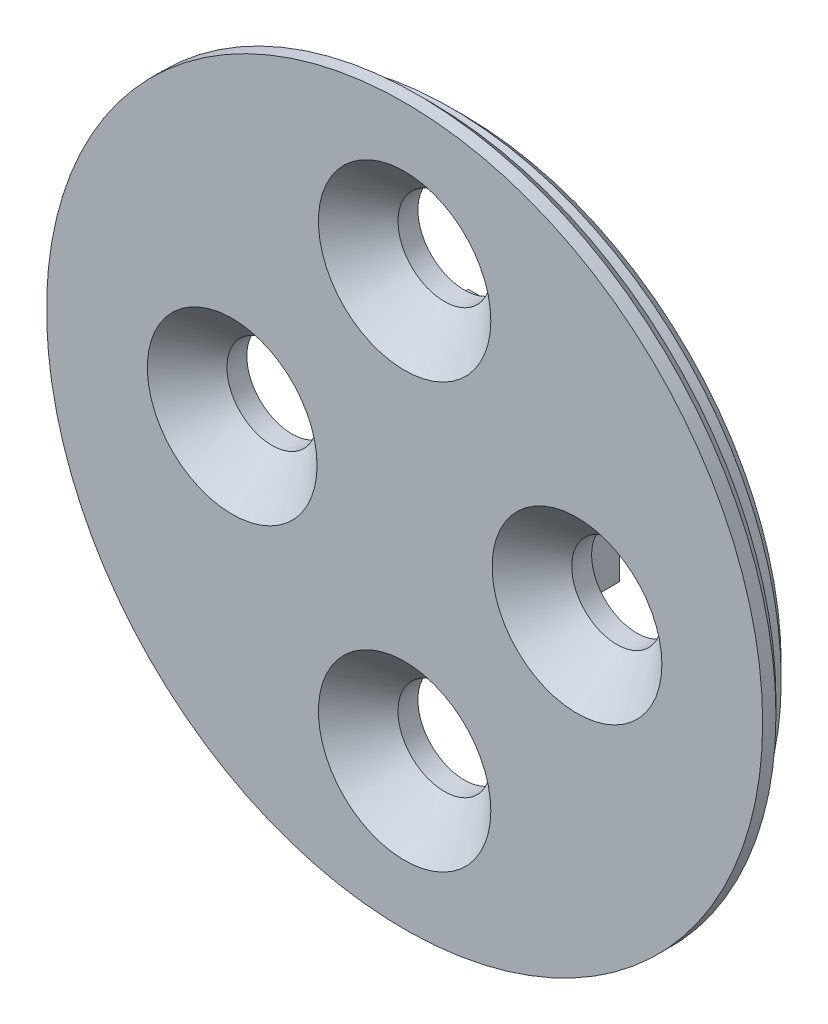
ISO-10303-21;
HEADER;
FILE_DESCRIPTION(('STEP AP214'),'2;1');
FILE_NAME('part.step','',(''),(''),'','','');
FILE_SCHEMA(('AUTOMOTIVE_DESIGN { 1 0 10303 214 1 1 1 1 }'));
ENDSEC;
DATA;
#1=APPLICATION_CONTEXT('core data for automotive mechanical design processes');
#2=APPLICATION_PROTOCOL_DEFINITION('international standard','automotive_design',2000,#1);
#3=PRODUCT_CONTEXT('',#1,'mechanical');
#4=PRODUCT('Part','Part','',(#3));
#5=PRODUCT_RELATED_PRODUCT_CATEGORY('part','',(#4));
#6=PRODUCT_DEFINITION_FORMATION('','',#4);
#7=PRODUCT_DEFINITION_CONTEXT('part definition',#1,'design');
#8=PRODUCT_DEFINITION('design','',#6,#7);
#9=PRODUCT_DEFINITION_SHAPE('','',#8);
#10=(LENGTH_UNIT() NAMED_UNIT(*) SI_UNIT(.MILLI.,.METRE.));
#11=(NAMED_UNIT(*) PLANE_ANGLE_UNIT() SI_UNIT($,.RADIAN.));
#12=(NAMED_UNIT(*) SI_UNIT($,.STERADIAN.) SOLID_ANGLE_UNIT());
#13=UNCERTAINTY_MEASURE_WITH_UNIT(LENGTH_MEASURE(1.E-05),#10,'distance_accuracy_value','');
#14=(GEOMETRIC_REPRESENTATION_CONTEXT(3) GLOBAL_UNCERTAINTY_ASSIGNED_CONTEXT((#13)) GLOBAL_UNIT_ASSIGNED_CONTEXT((#10,
#11,#12)) REPRESENTATION_CONTEXT('',''));
#15=CARTESIAN_POINT('',(0.,0.,0.));
#16=DIRECTION('',(0.,0.,1.));
#17=DIRECTION('',(1.,0.,0.));
#18=AXIS2_PLACEMENT_3D('',#15,#16,#17);
#19=CARTESIAN_POINT('',(0.,0.,-1.25));
#20=DIRECTION('',(0.,0.,1.));
#21=DIRECTION('',(1.,0.,0.));
#22=AXIS2_PLACEMENT_3D('',#19,#20,#21);
#23=PLANE('',#22);
#24=CARTESIAN_POINT('',(0.,8.,-1.25));
#25=DIRECTION('',(0.,0.,1.));
#26=DIRECTION('',(1.,0.,0.));
#27=AXIS2_PLACEMENT_3D('',#24,#25,#26);
#28=CIRCLE('',#27,1.75);
#29=CARTESIAN_POINT('',(1.75,8.,-1.25));
#30=VERTEX_POINT('',#29);
#31=EDGE_CURVE('E179',#30,#30,#28,.T.);
#32=ORIENTED_EDGE('',*,*,#31,.T.);
#33=EDGE_LOOP('',(#32));
#34=FACE_BOUND('',#33,.T.);
#35=CARTESIAN_POINT('',(0.,-8.,-1.25));
#36=DIRECTION('',(0.,0.,1.));
#37=DIRECTION('',(1.,0.,0.));
#38=AXIS2_PLACEMENT_3D('',#35,#36,#37);
#39=CIRCLE('',#38,1.75);
#40=CARTESIAN_POINT('',(1.75,-8.,-1.25));
#41=VERTEX_POINT('',#40);
#42=EDGE_CURVE('E365',#41,#41,#39,.T.);
#43=ORIENTED_EDGE('',*,*,#42,.T.);
#44=EDGE_LOOP('',(#43));
#45=FACE_BOUND('',#44,.T.);
#46=CARTESIAN_POINT('',(0.,0.,-1.25));
#47=DIRECTION('',(0.,0.,1.));
#48=DIRECTION('',(1.,0.,0.));
#49=AXIS2_PLACEMENT_3D('',#46,#47,#48);
#50=CIRCLE('',#49,11.95);
#51=CARTESIAN_POINT('',(11.95,0.,-1.25));
#52=VERTEX_POINT('',#51);
#53=EDGE_CURVE('E170',#52,#52,#50,.F.);
#54=ORIENTED_EDGE('',*,*,#53,.T.);
#55=EDGE_LOOP('',(#54));
#56=FACE_BOUND('',#55,.T.);
#57=CARTESIAN_POINT('',(-6.5,0.,-1.25));
#58=DIRECTION('',(0.,0.,1.));
#59=DIRECTION('',(1.,0.,0.));
#60=AXIS2_PLACEMENT_3D('',#57,#58,#59);
#61=CIRCLE('',#60,1.7);
#62=CARTESIAN_POINT('',(-4.8,0.,-1.25));
#63=VERTEX_POINT('',#62);
#64=EDGE_CURVE('E134',#63,#63,#61,.T.);
#65=ORIENTED_EDGE('',*,*,#64,.T.);
#66=EDGE_LOOP('',(#65));
#67=FACE_BOUND('',#66,.T.);
#68=CARTESIAN_POINT('',(6.5,0.,-1.25));
#69=DIRECTION('',(0.,0.,1.));
#70=DIRECTION('',(-1.,0.,0.));
#71=AXIS2_PLACEMENT_3D('',#68,#69,#70);
#72=CIRCLE('',#71,1.7);
#73=CARTESIAN_POINT('',(4.8,0.,-1.25));
#74=VERTEX_POINT('',#73);
#75=EDGE_CURVE('E130',#74,#74,#72,.T.);
#76=ORIENTED_EDGE('',*,*,#75,.T.);
#77=EDGE_LOOP('',(#76));
#78=FACE_BOUND('',#77,.T.);
#79=DIRECTION('',(0.,1.,0.));
#80=VECTOR('',#79,1.);
#81=CARTESIAN_POINT('',(-2.85,3.35,-1.25));
#82=LINE('',#81,#80);
#83=CARTESIAN_POINT('',(-2.85,-3.35,-1.25));
#84=VERTEX_POINT('',#83);
#85=CARTESIAN_POINT('',(-2.85,3.35,-1.25));
#86=VERTEX_POINT('',#85);
#87=EDGE_CURVE('E98',#84,#86,#82,.T.);
#88=ORIENTED_EDGE('',*,*,#87,.F.);
#89=DIRECTION('',(-1.,0.,0.));
#90=VECTOR('',#89,1.);
#91=CARTESIAN_POINT('',(2.85,-3.35,-1.25));
#92=LINE('',#91,#90);
#93=CARTESIAN_POINT('',(2.85,-3.35,-1.25));
#94=VERTEX_POINT('',#93);
#95=EDGE_CURVE('E102',#94,#84,#92,.T.);
#96=ORIENTED_EDGE('',*,*,#95,.F.);
#97=DIRECTION('',(0.,-1.,0.));
#98=VECTOR('',#97,1.);
#99=CARTESIAN_POINT('',(2.85,3.35,-1.25));
#100=LINE('',#99,#98);
#101=CARTESIAN_POINT('',(2.85,3.35,-1.25));
#102=VERTEX_POINT('',#101);
#103=EDGE_CURVE('E116',#102,#94,#100,.T.);
#104=ORIENTED_EDGE('',*,*,#103,.F.);
#105=DIRECTION('',(1.,0.,0.));
#106=VECTOR('',#105,1.);
#107=CARTESIAN_POINT('',(2.85,3.35,-1.25));
#108=LINE('',#107,#106);
#109=EDGE_CURVE('E110',#86,#102,#108,.T.);
#110=ORIENTED_EDGE('',*,*,#109,.F.);
#111=EDGE_LOOP('',(#88,#96,#104,#110));
#112=FACE_BOUND('',#111,.T.);
#113=ADVANCED_FACE('F41',(#34,#45,#56,#67,#78,#112),#23,.F.);
#114=CARTESIAN_POINT('',(0.,0.,-1.25));
#115=DIRECTION('',(0.,0.,1.));
#116=DIRECTION('',(1.,0.,0.));
#117=AXIS2_PLACEMENT_3D('',#114,#115,#116);
#118=CYLINDRICAL_SURFACE('',#117,12.45);
#119=CARTESIAN_POINT('',(0.,0.,-0.749999999999994));
#120=DIRECTION('',(0.,0.,1.));
#121=DIRECTION('',(1.,0.,0.));
#122=AXIS2_PLACEMENT_3D('',#119,#120,#121);
#123=CIRCLE('',#122,12.45);
#124=CARTESIAN_POINT('',(12.45,0.,-0.749999999999994));
#125=VERTEX_POINT('',#124);
#126=EDGE_CURVE('E166',#125,#125,#123,.T.);
#127=ORIENTED_EDGE('',*,*,#126,.T.);
#128=EDGE_LOOP('',(#127));
#129=FACE_BOUND('',#128,.T.);
#130=CARTESIAN_POINT('',(0.,0.,0.));
#131=DIRECTION('',(0.,0.,1.));
#132=DIRECTION('',(1.,0.,0.));
#133=AXIS2_PLACEMENT_3D('',#130,#131,#132);
#134=CIRCLE('',#133,12.45);
#135=CARTESIAN_POINT('',(12.45,0.,0.));
#136=VERTEX_POINT('',#135);
#137=EDGE_CURVE('E138',#136,#136,#134,.T.);
#138=ORIENTED_EDGE('',*,*,#137,.F.);
#139=EDGE_LOOP('',(#138));
#140=FACE_BOUND('',#139,.T.);
#141=ADVANCED_FACE('F237',(#129,#140),#118,.T.);
#142=CARTESIAN_POINT('',(-6.5,0.,-1.25));
#143=DIRECTION('',(0.,0.,1.));
#144=DIRECTION('',(1.,0.,0.));
#145=AXIS2_PLACEMENT_3D('',#142,#143,#144);
#146=CYLINDRICAL_SURFACE('',#145,1.7);
#147=CARTESIAN_POINT('',(-6.5,0.,-0.5));
#148=DIRECTION('',(0.,0.,1.));
#149=DIRECTION('',(1.,0.,0.));
#150=AXIS2_PLACEMENT_3D('',#147,#148,#149);
#151=CIRCLE('',#150,1.7);
#152=CARTESIAN_POINT('',(-4.8,0.,-0.5));
#153=VERTEX_POINT('',#152);
#154=EDGE_CURVE('E217',#153,#153,#151,.T.);
#155=ORIENTED_EDGE('',*,*,#154,.T.);
#156=EDGE_LOOP('',(#155));
#157=FACE_BOUND('',#156,.T.);
#158=ORIENTED_EDGE('',*,*,#64,.F.);
#159=EDGE_LOOP('',(#158));
#160=FACE_BOUND('',#159,.T.);
#161=ADVANCED_FACE('F243',(#157,#160),#146,.F.);
#162=CARTESIAN_POINT('',(6.5,0.,-1.25));
#163=DIRECTION('',(0.,0.,1.));
#164=DIRECTION('',(1.,0.,0.));
#165=AXIS2_PLACEMENT_3D('',#162,#163,#164);
#166=CYLINDRICAL_SURFACE('',#165,1.7);
#167=CARTESIAN_POINT('',(6.5,0.,-0.499999999999998));
#168=DIRECTION('',(0.,0.,1.));
#169=DIRECTION('',(1.,0.,0.));
#170=AXIS2_PLACEMENT_3D('',#167,#168,#169);
#171=CIRCLE('',#170,1.7);
#172=CARTESIAN_POINT('',(8.2,0.,-0.499999999999998));
#173=VERTEX_POINT('',#172);
#174=EDGE_CURVE('E213',#173,#173,#171,.T.);
#175=ORIENTED_EDGE('',*,*,#174,.T.);
#176=EDGE_LOOP('',(#175));
#177=FACE_BOUND('',#176,.T.);
#178=ORIENTED_EDGE('',*,*,#75,.F.);
#179=EDGE_LOOP('',(#178));
#180=FACE_BOUND('',#179,.T.);
#181=ADVANCED_FACE('F318',(#177,#180),#166,.F.);
#182=CARTESIAN_POINT('',(-2.85,3.35,-4.75));
#183=DIRECTION('',(1.,0.,0.));
#184=DIRECTION('',(0.,1.,0.));
#185=AXIS2_PLACEMENT_3D('',#182,#183,#184);
#186=PLANE('',#185);
#187=DIRECTION('',(0.,0.,1.));
#188=VECTOR('',#187,1.);
#189=CARTESIAN_POINT('',(-2.85,3.35,-4.75));
#190=LINE('',#189,#188);
#191=CARTESIAN_POINT('',(-2.85,3.35,-4.25));
#192=VERTEX_POINT('',#191);
#193=EDGE_CURVE('E127',#192,#86,#190,.T.);
#194=ORIENTED_EDGE('',*,*,#193,.F.);
#195=DIRECTION('',(0.,-1.,0.));
#196=VECTOR('',#195,1.);
#197=CARTESIAN_POINT('',(-2.85,-3.35,-4.25));
#198=LINE('',#197,#196);
#199=CARTESIAN_POINT('',(-2.85,-3.35,-4.25));
#200=VERTEX_POINT('',#199);
#201=EDGE_CURVE('E58',#192,#200,#198,.T.);
#202=ORIENTED_EDGE('',*,*,#201,.T.);
#203=DIRECTION('',(0.,0.,1.));
#204=VECTOR('',#203,1.);
#205=CARTESIAN_POINT('',(-2.85,-3.35,-4.75));
#206=LINE('',#205,#204);
#207=EDGE_CURVE('E95',#200,#84,#206,.T.);
#208=ORIENTED_EDGE('',*,*,#207,.T.);
#209=ORIENTED_EDGE('',*,*,#87,.T.);
#210=EDGE_LOOP('',(#194,#202,#208,#209));
#211=FACE_BOUND('',#210,.T.);
#212=ADVANCED_FACE('F97',(#211),#186,.F.);
#213=CARTESIAN_POINT('',(2.85,3.35,-4.75));
#214=DIRECTION('',(0.,-1.,0.));
#215=DIRECTION('',(0.,0.,-1.));
#216=AXIS2_PLACEMENT_3D('',#213,#214,#215);
#217=PLANE('',#216);
#218=DIRECTION('',(0.,0.,1.));
#219=VECTOR('',#218,1.);
#220=CARTESIAN_POINT('',(2.85,3.35,-4.75));
#221=LINE('',#220,#219);
#222=CARTESIAN_POINT('',(2.85,3.35,-4.25));
#223=VERTEX_POINT('',#222);
#224=EDGE_CURVE('E124',#223,#102,#221,.T.);
#225=ORIENTED_EDGE('',*,*,#224,.F.);
#226=DIRECTION('',(-1.,0.,0.));
#227=VECTOR('',#226,1.);
#228=CARTESIAN_POINT('',(-2.85,3.35,-4.25));
#229=LINE('',#228,#227);
#230=EDGE_CURVE('E155',#223,#192,#229,.T.);
#231=ORIENTED_EDGE('',*,*,#230,.T.);
#232=ORIENTED_EDGE('',*,*,#193,.T.);
#233=ORIENTED_EDGE('',*,*,#109,.T.);
#234=EDGE_LOOP('',(#225,#231,#232,#233));
#235=FACE_BOUND('',#234,.T.);
#236=ADVANCED_FACE('F327',(#235),#217,.F.);
#237=CARTESIAN_POINT('',(2.85,3.35,-4.75));
#238=DIRECTION('',(-1.,0.,0.));
#239=DIRECTION('',(0.,-1.,0.));
#240=AXIS2_PLACEMENT_3D('',#237,#238,#239);
#241=PLANE('',#240);
#242=DIRECTION('',(0.,0.,1.));
#243=VECTOR('',#242,1.);
#244=CARTESIAN_POINT('',(2.85,-3.35,-4.75));
#245=LINE('',#244,#243);
#246=CARTESIAN_POINT('',(2.85,-3.35,-4.25));
#247=VERTEX_POINT('',#246);
#248=EDGE_CURVE('E101',#247,#94,#245,.T.);
#249=ORIENTED_EDGE('',*,*,#248,.F.);
#250=DIRECTION('',(0.,1.,0.));
#251=VECTOR('',#250,1.);
#252=CARTESIAN_POINT('',(2.85,3.35,-4.25));
#253=LINE('',#252,#251);
#254=EDGE_CURVE('E159',#247,#223,#253,.T.);
#255=ORIENTED_EDGE('',*,*,#254,.T.);
#256=ORIENTED_EDGE('',*,*,#224,.T.);
#257=ORIENTED_EDGE('',*,*,#103,.T.);
#258=EDGE_LOOP('',(#249,#255,#256,#257));
#259=FACE_BOUND('',#258,.T.);
#260=ADVANCED_FACE('F333',(#259),#241,.F.);
#261=CARTESIAN_POINT('',(2.85,-3.35,-4.75));
#262=DIRECTION('',(0.,1.,0.));
#263=DIRECTION('',(0.,0.,1.));
#264=AXIS2_PLACEMENT_3D('',#261,#262,#263);
#265=PLANE('',#264);
#266=ORIENTED_EDGE('',*,*,#207,.F.);
#267=DIRECTION('',(1.,0.,0.));
#268=VECTOR('',#267,1.);
#269=CARTESIAN_POINT('',(2.85,-3.35,-4.25));
#270=LINE('',#269,#268);
#271=EDGE_CURVE('E65',#200,#247,#270,.T.);
#272=ORIENTED_EDGE('',*,*,#271,.T.);
#273=ORIENTED_EDGE('',*,*,#248,.T.);
#274=ORIENTED_EDGE('',*,*,#95,.T.);
#275=EDGE_LOOP('',(#266,#272,#273,#274));
#276=FACE_BOUND('',#275,.T.);
#277=ADVANCED_FACE('F114',(#276),#265,.F.);
#278=CARTESIAN_POINT('',(0.,0.,-4.75));
#279=DIRECTION('',(0.,0.,-1.));
#280=DIRECTION('',(-1.,0.,0.));
#281=AXIS2_PLACEMENT_3D('',#278,#279,#280);
#282=PLANE('',#281);
#283=DIRECTION('',(0.,1.,0.));
#284=VECTOR('',#283,1.);
#285=CARTESIAN_POINT('',(-2.35,3.35,-4.75));
#286=LINE('',#285,#284);
#287=CARTESIAN_POINT('',(-2.35,-2.85,-4.75));
#288=VERTEX_POINT('',#287);
#289=CARTESIAN_POINT('',(-2.35,2.85,-4.75));
#290=VERTEX_POINT('',#289);
#291=EDGE_CURVE('E142',#288,#290,#286,.T.);
#292=ORIENTED_EDGE('',*,*,#291,.T.);
#293=DIRECTION('',(1.,0.,0.));
#294=VECTOR('',#293,1.);
#295=CARTESIAN_POINT('',(2.85,2.85,-4.75));
#296=LINE('',#295,#294);
#297=CARTESIAN_POINT('',(2.35,2.85,-4.75));
#298=VERTEX_POINT('',#297);
#299=EDGE_CURVE('E151',#290,#298,#296,.T.);
#300=ORIENTED_EDGE('',*,*,#299,.T.);
#301=DIRECTION('',(0.,-1.,0.));
#302=VECTOR('',#301,1.);
#303=CARTESIAN_POINT('',(2.35,-3.35,-4.75));
#304=LINE('',#303,#302);
#305=CARTESIAN_POINT('',(2.35,-2.85,-4.75));
#306=VERTEX_POINT('',#305);
#307=EDGE_CURVE('E148',#298,#306,#304,.T.);
#308=ORIENTED_EDGE('',*,*,#307,.T.);
#309=DIRECTION('',(-1.,0.,0.));
#310=VECTOR('',#309,1.);
#311=CARTESIAN_POINT('',(-2.85,-2.85,-4.75));
#312=LINE('',#311,#310);
#313=EDGE_CURVE('E145',#306,#288,#312,.T.);
#314=ORIENTED_EDGE('',*,*,#313,.T.);
#315=EDGE_LOOP('',(#292,#300,#308,#314));
#316=FACE_BOUND('',#315,.T.);
#317=ADVANCED_FACE('F340',(#316),#282,.T.);
#318=CARTESIAN_POINT('',(0.,0.,1.));
#319=DIRECTION('',(0.,0.,1.));
#320=DIRECTION('',(1.,0.,0.));
#321=AXIS2_PLACEMENT_3D('',#318,#319,#320);
#322=PLANE('',#321);
#323=CARTESIAN_POINT('',(0.,8.,1.));
#324=DIRECTION('',(0.,0.,1.));
#325=DIRECTION('',(1.,0.,0.));
#326=AXIS2_PLACEMENT_3D('',#323,#324,#325);
#327=CIRCLE('',#326,3.25);
#328=CARTESIAN_POINT('',(3.25,8.,1.));
#329=VERTEX_POINT('',#328);
#330=EDGE_CURVE('E205',#329,#329,#327,.F.);
#331=ORIENTED_EDGE('',*,*,#330,.T.);
#332=EDGE_LOOP('',(#331));
#333=FACE_BOUND('',#332,.T.);
#334=CARTESIAN_POINT('',(0.,-8.,1.));
#335=DIRECTION('',(0.,0.,1.));
#336=DIRECTION('',(1.,0.,0.));
#337=AXIS2_PLACEMENT_3D('',#334,#335,#336);
#338=CIRCLE('',#337,3.25);
#339=CARTESIAN_POINT('',(3.25,-8.,1.));
#340=VERTEX_POINT('',#339);
#341=EDGE_CURVE('E201',#340,#340,#338,.F.);
#342=ORIENTED_EDGE('',*,*,#341,.T.);
#343=EDGE_LOOP('',(#342));
#344=FACE_BOUND('',#343,.T.);
#345=CARTESIAN_POINT('',(6.5,0.,1.));
#346=DIRECTION('',(0.,0.,1.));
#347=DIRECTION('',(1.,0.,0.));
#348=AXIS2_PLACEMENT_3D('',#345,#346,#347);
#349=CIRCLE('',#348,3.20000000000001);
#350=CARTESIAN_POINT('',(9.7,0.,1.));
#351=VERTEX_POINT('',#350);
#352=EDGE_CURVE('E197',#351,#351,#349,.F.);
#353=ORIENTED_EDGE('',*,*,#352,.T.);
#354=EDGE_LOOP('',(#353));
#355=FACE_BOUND('',#354,.T.);
#356=CARTESIAN_POINT('',(-6.5,0.,1.));
#357=DIRECTION('',(0.,0.,1.));
#358=DIRECTION('',(1.,0.,0.));
#359=AXIS2_PLACEMENT_3D('',#356,#357,#358);
#360=CIRCLE('',#359,3.2);
#361=CARTESIAN_POINT('',(-3.29999999999999,0.,1.));
#362=VERTEX_POINT('',#361);
#363=EDGE_CURVE('E193',#362,#362,#360,.F.);
#364=ORIENTED_EDGE('',*,*,#363,.T.);
#365=EDGE_LOOP('',(#364));
#366=FACE_BOUND('',#365,.T.);
#367=CARTESIAN_POINT('',(0.,0.,1.));
#368=DIRECTION('',(0.,0.,1.));
#369=DIRECTION('',(1.,0.,0.));
#370=AXIS2_PLACEMENT_3D('',#367,#368,#369);
#371=CIRCLE('',#370,13.5);
#372=CARTESIAN_POINT('',(13.5,0.,1.));
#373=VERTEX_POINT('',#372);
#374=EDGE_CURVE('E112',#373,#373,#371,.T.);
#375=ORIENTED_EDGE('',*,*,#374,.T.);
#376=EDGE_LOOP('',(#375));
#377=FACE_BOUND('',#376,.T.);
#378=ADVANCED_FACE('F343',(#333,#344,#355,#366,#377),#322,.T.);
#379=CARTESIAN_POINT('',(0.,0.,0.));
#380=DIRECTION('',(0.,0.,1.));
#381=DIRECTION('',(1.,0.,0.));
#382=AXIS2_PLACEMENT_3D('',#379,#380,#381);
#383=PLANE('',#382);
#384=CARTESIAN_POINT('',(0.,0.,0.));
#385=DIRECTION('',(0.,0.,1.));
#386=DIRECTION('',(1.,0.,0.));
#387=AXIS2_PLACEMENT_3D('',#384,#385,#386);
#388=CIRCLE('',#387,13.);
#389=CARTESIAN_POINT('',(13.,0.,0.));
#390=VERTEX_POINT('',#389);
#391=EDGE_CURVE('E11',#390,#390,#388,.F.);
#392=ORIENTED_EDGE('',*,*,#391,.T.);
#393=EDGE_LOOP('',(#392));
#394=FACE_BOUND('',#393,.T.);
#395=ORIENTED_EDGE('',*,*,#137,.T.);
#396=EDGE_LOOP('',(#395));
#397=FACE_BOUND('',#396,.T.);
#398=ADVANCED_FACE('F347',(#394,#397),#383,.F.);
#399=CARTESIAN_POINT('',(0.,0.,1.));
#400=DIRECTION('',(0.,0.,-1.));
#401=DIRECTION('',(-1.,0.,0.));
#402=AXIS2_PLACEMENT_3D('',#399,#400,#401);
#403=CYLINDRICAL_SURFACE('',#402,13.5);
#404=CARTESIAN_POINT('',(0.,0.,0.5));
#405=DIRECTION('',(0.,0.,1.));
#406=DIRECTION('',(1.,0.,0.));
#407=AXIS2_PLACEMENT_3D('',#404,#405,#406);
#408=CIRCLE('',#407,13.5);
#409=CARTESIAN_POINT('',(13.5,0.,0.5));
#410=VERTEX_POINT('',#409);
#411=EDGE_CURVE('E51',#410,#410,#408,.T.);
#412=ORIENTED_EDGE('',*,*,#411,.T.);
#413=EDGE_LOOP('',(#412));
#414=FACE_BOUND('',#413,.T.);
#415=ORIENTED_EDGE('',*,*,#374,.F.);
#416=EDGE_LOOP('',(#415));
#417=FACE_BOUND('',#416,.T.);
#418=ADVANCED_FACE('F224',(#414,#417),#403,.T.);
#419=CARTESIAN_POINT('',(0.,-2.85,-4.75));
#420=DIRECTION('',(0.,-0.70710678118655,-0.707106781186545));
#421=DIRECTION('',(1.,0.,0.));
#422=AXIS2_PLACEMENT_3D('',#419,#420,#421);
#423=PLANE('',#422);
#424=DIRECTION('',(0.577350269189624,-0.577350269189624,0.577350269189628));
#425=VECTOR('',#424,1.);
#426=CARTESIAN_POINT('',(1.56666666666667,-2.06666666666667,-5.53333333333334));
#427=LINE('',#426,#425);
#428=EDGE_CURVE('E182',#247,#306,#427,.F.);
#429=ORIENTED_EDGE('',*,*,#428,.F.);
#430=ORIENTED_EDGE('',*,*,#271,.F.);
#431=DIRECTION('',(-0.577350269189625,-0.577350269189624,0.577350269189628));
#432=VECTOR('',#431,1.);
#433=CARTESIAN_POINT('',(-1.40000000000001,-1.90000000000001,-5.7));
#434=LINE('',#433,#432);
#435=EDGE_CURVE('E186',#288,#200,#434,.T.);
#436=ORIENTED_EDGE('',*,*,#435,.F.);
#437=ORIENTED_EDGE('',*,*,#313,.F.);
#438=EDGE_LOOP('',(#429,#430,#436,#437));
#439=FACE_BOUND('',#438,.T.);
#440=ADVANCED_FACE('F274',(#439),#423,.T.);
#441=CARTESIAN_POINT('',(-2.35,0.,-4.75));
#442=DIRECTION('',(-0.70710678118655,0.,-0.707106781186545));
#443=DIRECTION('',(0.,-1.,0.));
#444=AXIS2_PLACEMENT_3D('',#441,#442,#443);
#445=PLANE('',#444);
#446=ORIENTED_EDGE('',*,*,#435,.T.);
#447=ORIENTED_EDGE('',*,*,#201,.F.);
#448=DIRECTION('',(0.577350269189624,-0.577350269189624,-0.577350269189628));
#449=VECTOR('',#448,1.);
#450=CARTESIAN_POINT('',(-1.40000000000001,1.90000000000001,-5.7));
#451=LINE('',#450,#449);
#452=EDGE_CURVE('E178',#290,#192,#451,.F.);
#453=ORIENTED_EDGE('',*,*,#452,.F.);
#454=ORIENTED_EDGE('',*,*,#291,.F.);
#455=EDGE_LOOP('',(#446,#447,#453,#454));
#456=FACE_BOUND('',#455,.T.);
#457=ADVANCED_FACE('F267',(#456),#445,.T.);
#458=CARTESIAN_POINT('',(2.35,0.,-4.75));
#459=DIRECTION('',(0.70710678118655,0.,-0.707106781186545));
#460=DIRECTION('',(0.,1.,0.));
#461=AXIS2_PLACEMENT_3D('',#458,#459,#460);
#462=PLANE('',#461);
#463=ORIENTED_EDGE('',*,*,#428,.T.);
#464=ORIENTED_EDGE('',*,*,#307,.F.);
#465=DIRECTION('',(0.577350269189625,0.577350269189624,0.577350269189628));
#466=VECTOR('',#465,1.);
#467=CARTESIAN_POINT('',(1.40000000000001,1.90000000000001,-5.7));
#468=LINE('',#467,#466);
#469=EDGE_CURVE('E175',#223,#298,#468,.F.);
#470=ORIENTED_EDGE('',*,*,#469,.F.);
#471=ORIENTED_EDGE('',*,*,#254,.F.);
#472=EDGE_LOOP('',(#463,#464,#470,#471));
#473=FACE_BOUND('',#472,.T.);
#474=ADVANCED_FACE('F260',(#473),#462,.T.);
#475=CARTESIAN_POINT('',(0.,2.85,-4.75));
#476=DIRECTION('',(0.,0.70710678118655,-0.707106781186545));
#477=DIRECTION('',(-1.,0.,0.));
#478=AXIS2_PLACEMENT_3D('',#475,#476,#477);
#479=PLANE('',#478);
#480=ORIENTED_EDGE('',*,*,#452,.T.);
#481=ORIENTED_EDGE('',*,*,#230,.F.);
#482=ORIENTED_EDGE('',*,*,#469,.T.);
#483=ORIENTED_EDGE('',*,*,#299,.F.);
#484=EDGE_LOOP('',(#480,#481,#482,#483));
#485=FACE_BOUND('',#484,.T.);
#486=ADVANCED_FACE('F252',(#485),#479,.T.);
#487=CARTESIAN_POINT('',(0.,0.,-0.749999999999994));
#488=DIRECTION('',(0.,0.,1.));
#489=DIRECTION('',(1.,0.,0.));
#490=AXIS2_PLACEMENT_3D('',#487,#488,#489);
#491=CONICAL_SURFACE('',#490,12.45,0.785398163397448);
#492=ORIENTED_EDGE('',*,*,#53,.F.);
#493=EDGE_LOOP('',(#492));
#494=FACE_BOUND('',#493,.T.);
#495=ORIENTED_EDGE('',*,*,#126,.F.);
#496=EDGE_LOOP('',(#495));
#497=FACE_BOUND('',#496,.T.);
#498=ADVANCED_FACE('F259',(#494,#497),#491,.T.);
#499=CARTESIAN_POINT('',(0.,-8.,-4.75));
#500=DIRECTION('',(0.,0.,1.));
#501=DIRECTION('',(1.,0.,0.));
#502=AXIS2_PLACEMENT_3D('',#499,#500,#501);
#503=CYLINDRICAL_SURFACE('',#502,1.75);
#504=CARTESIAN_POINT('',(0.,-8.,-0.499999999999993));
#505=DIRECTION('',(0.,0.,1.));
#506=DIRECTION('',(1.,0.,0.));
#507=AXIS2_PLACEMENT_3D('',#504,#505,#506);
#508=CIRCLE('',#507,1.75);
#509=CARTESIAN_POINT('',(1.75,-8.,-0.499999999999993));
#510=VERTEX_POINT('',#509);
#511=EDGE_CURVE('E209',#510,#510,#508,.T.);
#512=ORIENTED_EDGE('',*,*,#511,.T.);
#513=EDGE_LOOP('',(#512));
#514=FACE_BOUND('',#513,.T.);
#515=ORIENTED_EDGE('',*,*,#42,.F.);
#516=EDGE_LOOP('',(#515));
#517=FACE_BOUND('',#516,.T.);
#518=ADVANCED_FACE('F286',(#514,#517),#503,.F.);
#519=CARTESIAN_POINT('',(0.,8.,-4.75));
#520=DIRECTION('',(0.,0.,1.));
#521=DIRECTION('',(1.,0.,0.));
#522=AXIS2_PLACEMENT_3D('',#519,#520,#521);
#523=CYLINDRICAL_SURFACE('',#522,1.75);
#524=CARTESIAN_POINT('',(0.,8.,-0.499999999999993));
#525=DIRECTION('',(0.,0.,1.));
#526=DIRECTION('',(1.,0.,0.));
#527=AXIS2_PLACEMENT_3D('',#524,#525,#526);
#528=CIRCLE('',#527,1.75);
#529=CARTESIAN_POINT('',(1.75,8.,-0.499999999999993));
#530=VERTEX_POINT('',#529);
#531=EDGE_CURVE('E174',#530,#530,#528,.T.);
#532=ORIENTED_EDGE('',*,*,#531,.T.);
#533=EDGE_LOOP('',(#532));
#534=FACE_BOUND('',#533,.T.);
#535=ORIENTED_EDGE('',*,*,#31,.F.);
#536=EDGE_LOOP('',(#535));
#537=FACE_BOUND('',#536,.T.);
#538=ADVANCED_FACE('F295',(#534,#537),#523,.F.);
#539=CARTESIAN_POINT('',(0.,8.,-0.499999999999993));
#540=DIRECTION('',(0.,0.,1.));
#541=DIRECTION('',(1.,0.,0.));
#542=AXIS2_PLACEMENT_3D('',#539,#540,#541);
#543=CONICAL_SURFACE('',#542,1.75,0.785398163397451);
#544=ORIENTED_EDGE('',*,*,#330,.F.);
#545=EDGE_LOOP('',(#544));
#546=FACE_BOUND('',#545,.T.);
#547=ORIENTED_EDGE('',*,*,#531,.F.);
#548=EDGE_LOOP('',(#547));
#549=FACE_BOUND('',#548,.T.);
#550=ADVANCED_FACE('F288',(#546,#549),#543,.F.);
#551=CARTESIAN_POINT('',(0.,-8.,-0.499999999999993));
#552=DIRECTION('',(0.,0.,1.));
#553=DIRECTION('',(1.,0.,0.));
#554=AXIS2_PLACEMENT_3D('',#551,#552,#553);
#555=CONICAL_SURFACE('',#554,1.75,0.785398163397451);
#556=ORIENTED_EDGE('',*,*,#341,.F.);
#557=EDGE_LOOP('',(#556));
#558=FACE_BOUND('',#557,.T.);
#559=ORIENTED_EDGE('',*,*,#511,.F.);
#560=EDGE_LOOP('',(#559));
#561=FACE_BOUND('',#560,.T.);
#562=ADVANCED_FACE('F294',(#558,#561),#555,.F.);
#563=CARTESIAN_POINT('',(6.5,0.,-0.499999999999998));
#564=DIRECTION('',(0.,0.,1.));
#565=DIRECTION('',(1.,0.,0.));
#566=AXIS2_PLACEMENT_3D('',#563,#564,#565);
#567=CONICAL_SURFACE('',#566,1.7,0.785398163397451);
#568=ORIENTED_EDGE('',*,*,#352,.F.);
#569=EDGE_LOOP('',(#568));
#570=FACE_BOUND('',#569,.T.);
#571=ORIENTED_EDGE('',*,*,#174,.F.);
#572=EDGE_LOOP('',(#571));
#573=FACE_BOUND('',#572,.T.);
#574=ADVANCED_FACE('F233',(#570,#573),#567,.F.);
#575=CARTESIAN_POINT('',(-6.5,0.,-0.5));
#576=DIRECTION('',(0.,0.,1.));
#577=DIRECTION('',(1.,0.,0.));
#578=AXIS2_PLACEMENT_3D('',#575,#576,#577);
#579=CONICAL_SURFACE('',#578,1.7,0.78539816339745);
#580=CARTESIAN_POINT('',(-3.29999999999999,0.,1.));
#581=CARTESIAN_POINT('',(-3.31562499999999,0.,0.984375));
#582=CARTESIAN_POINT('',(-3.33124999999999,0.,0.96875));
#583=CARTESIAN_POINT('',(-3.36249999999999,0.,0.9375));
#584=CARTESIAN_POINT('',(-3.37812499999999,0.,0.921875));
#585=CARTESIAN_POINT('',(-3.40937499999999,0.,0.890625));
#586=CARTESIAN_POINT('',(-3.42499999999999,0.,0.875));
#587=CARTESIAN_POINT('',(-3.45624999999999,0.,0.84375));
#588=CARTESIAN_POINT('',(-3.47187499999999,0.,0.828125));
#589=CARTESIAN_POINT('',(-3.50312499999999,0.,0.796875));
#590=CARTESIAN_POINT('',(-3.51874999999999,0.,0.78125));
#591=CARTESIAN_POINT('',(-3.54999999999999,0.,0.75));
#592=CARTESIAN_POINT('',(-3.56562499999999,0.,0.734375));
#593=CARTESIAN_POINT('',(-3.59687499999999,0.,0.703125));
#594=CARTESIAN_POINT('',(-3.61249999999999,0.,0.6875));
#595=CARTESIAN_POINT('',(-3.64374999999999,0.,0.65625));
#596=CARTESIAN_POINT('',(-3.65937499999999,0.,0.640625));
#597=CARTESIAN_POINT('',(-3.69062499999999,0.,0.609375));
#598=CARTESIAN_POINT('',(-3.70624999999999,0.,0.59375));
#599=CARTESIAN_POINT('',(-3.7375,0.,0.5625));
#600=CARTESIAN_POINT('',(-3.753125,0.,0.546875));
#601=CARTESIAN_POINT('',(-3.784375,0.,0.515625));
#602=CARTESIAN_POINT('',(-3.8,0.,0.5));
#603=CARTESIAN_POINT('',(-3.83125,0.,0.46875));
#604=CARTESIAN_POINT('',(-3.846875,0.,0.453125));
#605=CARTESIAN_POINT('',(-3.878125,0.,0.421875));
#606=CARTESIAN_POINT('',(-3.89375,0.,0.40625));
#607=CARTESIAN_POINT('',(-3.925,0.,0.375));
#608=CARTESIAN_POINT('',(-3.940625,0.,0.359375));
#609=CARTESIAN_POINT('',(-3.971875,0.,0.328125));
#610=CARTESIAN_POINT('',(-3.9875,0.,0.3125));
#611=CARTESIAN_POINT('',(-4.01875,0.,0.28125));
#612=CARTESIAN_POINT('',(-4.034375,0.,0.265625));
#613=CARTESIAN_POINT('',(-4.065625,0.,0.234375));
#614=CARTESIAN_POINT('',(-4.08125,0.,0.21875));
#615=CARTESIAN_POINT('',(-4.1125,0.,0.1875));
#616=CARTESIAN_POINT('',(-4.128125,0.,0.171875));
#617=CARTESIAN_POINT('',(-4.159375,0.,0.140625));
#618=CARTESIAN_POINT('',(-4.175,0.,0.125));
#619=CARTESIAN_POINT('',(-4.20625,0.,0.0937499999999999));
#620=CARTESIAN_POINT('',(-4.221875,0.,0.0781249999999999));
#621=CARTESIAN_POINT('',(-4.253125,0.,0.0468749999999999));
#622=CARTESIAN_POINT('',(-4.26875,0.,0.0312499999999999));
#623=CARTESIAN_POINT('',(-4.3,0.,0.));
#624=CARTESIAN_POINT('',(-4.315625,0.,-0.0156250000000002));
#625=CARTESIAN_POINT('',(-4.346875,0.,-0.0468750000000001));
#626=CARTESIAN_POINT('',(-4.3625,0.,-0.0625000000000001));
#627=CARTESIAN_POINT('',(-4.39375,0.,-0.0937500000000001));
#628=CARTESIAN_POINT('',(-4.409375,0.,-0.109375));
#629=CARTESIAN_POINT('',(-4.440625,0.,-0.140625));
#630=CARTESIAN_POINT('',(-4.45625,0.,-0.15625));
#631=CARTESIAN_POINT('',(-4.4875,0.,-0.1875));
#632=CARTESIAN_POINT('',(-4.503125,0.,-0.203125));
#633=CARTESIAN_POINT('',(-4.534375,0.,-0.234375));
#634=CARTESIAN_POINT('',(-4.55,0.,-0.25));
#635=CARTESIAN_POINT('',(-4.58125,0.,-0.28125));
#636=CARTESIAN_POINT('',(-4.596875,0.,-0.296875));
#637=CARTESIAN_POINT('',(-4.628125,0.,-0.328125));
#638=CARTESIAN_POINT('',(-4.64375,0.,-0.34375));
#639=CARTESIAN_POINT('',(-4.675,0.,-0.375));
#640=CARTESIAN_POINT('',(-4.690625,0.,-0.390625));
#641=CARTESIAN_POINT('',(-4.721875,0.,-0.421875));
#642=CARTESIAN_POINT('',(-4.7375,0.,-0.4375));
#643=CARTESIAN_POINT('',(-4.76875,0.,-0.46875));
#644=CARTESIAN_POINT('',(-4.784375,0.,-0.484375));
#645=CARTESIAN_POINT('',(-4.8,0.,-0.5));
#646=B_SPLINE_CURVE_WITH_KNOTS('',3,(#580,#581,#582,#583,#584,#585,#586,#587,#588,#589,#590,
#591,#592,#593,#594,#595,#596,#597,#598,#599,#600,#601,#602,#603,#604,#605,#606,#607,#608,#609,
#610,#611,#612,#613,#614,#615,#616,#617,#618,#619,#620,#621,#622,#623,#624,#625,#626,#627,#628,
#629,#630,#631,#632,#633,#634,#635,#636,#637,#638,#639,#640,#641,#642,#643,#644,#645),
.UNSPECIFIED.,.F.,.F.,(4,2,2,2,2,2,2,2,2,2,2,2,2,2,2,2,2,2,2,2,2,2,2,2,2,2,2,2,2,2,2,2,4),(0.,
0.0662912607362392,0.132582521472478,0.198873782208717,0.265165042944956,0.331456303681195,
0.397747564417434,0.464038825153673,0.530330085889911,0.59662134662615,0.662912607362389,
0.729203868098629,0.795495128834867,0.861786389571107,0.928077650307345,0.994368911043584,
1.06066017177982,1.12695143251606,1.1932426932523,1.25953395398854,1.32582521472478,
1.39211647546102,1.45840773619726,1.5246989969335,1.59099025766973,1.65728151840597,
1.72357277914221,1.78986403987845,1.85615530061469,1.92244656135093,1.98873782208717,
2.05502908282341,2.12132034355965),.UNSPECIFIED.);
#647=EDGE_CURVE('BSEAM228',#362,#153,#646,.T.);
#648=ORIENTED_EDGE('',*,*,#363,.F.);
#649=ORIENTED_EDGE('',*,*,#154,.F.);
#650=ORIENTED_EDGE('',*,*,#647,.T.);
#651=ORIENTED_EDGE('',*,*,#647,.F.);
#652=EDGE_LOOP('',(#648,#650,#649,#651));
#653=FACE_BOUND('',#652,.T.);
#654=ADVANCED_FACE('F228',(#653),#579,.F.);
#655=CARTESIAN_POINT('',(0.,0.,0.5));
#656=DIRECTION('',(0.,0.,1.));
#657=DIRECTION('',(1.,0.,0.));
#658=AXIS2_PLACEMENT_3D('',#655,#656,#657);
#659=CONICAL_SURFACE('',#658,13.5,0.78539816339745);
#660=ORIENTED_EDGE('',*,*,#391,.F.);
#661=EDGE_LOOP('',(#660));
#662=FACE_BOUND('',#661,.T.);
#663=ORIENTED_EDGE('',*,*,#411,.F.);
#664=EDGE_LOOP('',(#663));
#665=FACE_BOUND('',#664,.T.);
#666=ADVANCED_FACE('F44',(#662,#665),#659,.T.);
#667=CLOSED_SHELL('',(#113,#141,#161,#181,#212,#236,#260,#277,#317,#378,#398,#418,#440,#457,
#474,#486,#498,#518,#538,#550,#562,#574,#654,#666));
#668=MANIFOLD_SOLID_BREP('B2',#667);
#669=ADVANCED_BREP_SHAPE_REPRESENTATION('',(#18,#668),#14);
#670=SHAPE_DEFINITION_REPRESENTATION(#9,#669);
ENDSEC;
END-ISO-10303-21;
